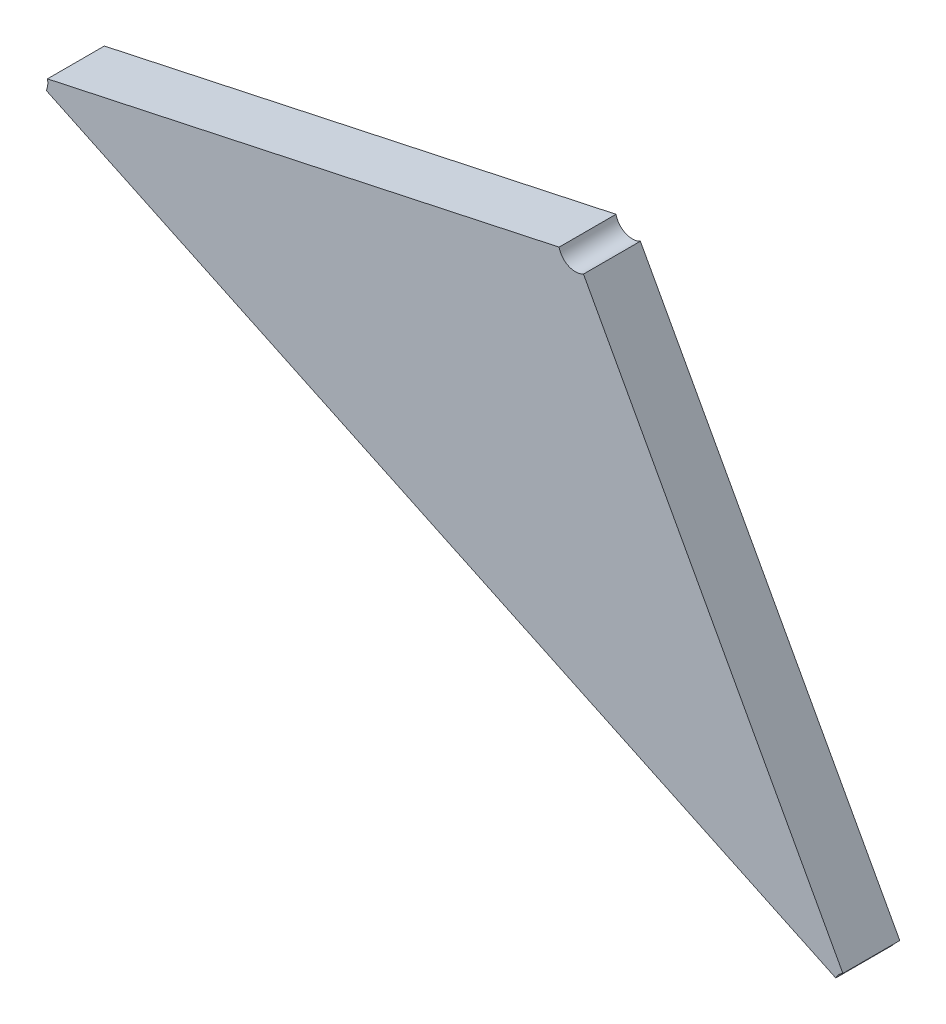
ISO-10303-21;
HEADER;
FILE_DESCRIPTION(('STEP AP214'),'2;1');
FILE_NAME('part.step','',(''),(''),'','','');
FILE_SCHEMA(('AUTOMOTIVE_DESIGN { 1 0 10303 214 1 1 1 1 }'));
ENDSEC;
DATA;
#1=APPLICATION_CONTEXT('core data for automotive mechanical design processes');
#2=APPLICATION_PROTOCOL_DEFINITION('international standard','automotive_design',2000,#1);
#3=PRODUCT_CONTEXT('',#1,'mechanical');
#4=PRODUCT('Part','Part','',(#3));
#5=PRODUCT_RELATED_PRODUCT_CATEGORY('part','',(#4));
#6=PRODUCT_DEFINITION_FORMATION('','',#4);
#7=PRODUCT_DEFINITION_CONTEXT('part definition',#1,'design');
#8=PRODUCT_DEFINITION('design','',#6,#7);
#9=PRODUCT_DEFINITION_SHAPE('','',#8);
#10=(LENGTH_UNIT() NAMED_UNIT(*) SI_UNIT(.MILLI.,.METRE.));
#11=(NAMED_UNIT(*) PLANE_ANGLE_UNIT() SI_UNIT($,.RADIAN.));
#12=(NAMED_UNIT(*) SI_UNIT($,.STERADIAN.) SOLID_ANGLE_UNIT());
#13=UNCERTAINTY_MEASURE_WITH_UNIT(LENGTH_MEASURE(1.E-05),#10,'distance_accuracy_value','');
#14=(GEOMETRIC_REPRESENTATION_CONTEXT(3) GLOBAL_UNCERTAINTY_ASSIGNED_CONTEXT((#13)) GLOBAL_UNIT_ASSIGNED_CONTEXT((#10,
#11,#12)) REPRESENTATION_CONTEXT('',''));
#15=CARTESIAN_POINT('',(0.,0.,0.));
#16=DIRECTION('',(0.,0.,1.));
#17=DIRECTION('',(1.,0.,0.));
#18=AXIS2_PLACEMENT_3D('',#15,#16,#17);
#19=CARTESIAN_POINT('',(-1.59189867768848,-1.40831289575818,0.0042));
#20=DIRECTION('',(0.,0.,1.));
#21=DIRECTION('',(1.,0.,0.));
#22=AXIS2_PLACEMENT_3D('',#19,#20,#21);
#23=PLANE('',#22);
#24=CARTESIAN_POINT('',(-1.54763776832546,-1.44184706335933,0.0042));
#25=DIRECTION('',(0.,0.,-1.));
#26=DIRECTION('',(-0.903806397976083,0.427941578930463,0.));
#27=AXIS2_PLACEMENT_3D('',#24,#25,#26);
#28=CIRCLE('',#27,0.00200000000000001);
#29=CARTESIAN_POINT('',(-1.54944538112141,-1.44099118020147,0.0042));
#30=VERTEX_POINT('',#29);
#31=CARTESIAN_POINT('',(-1.54859494511503,-1.4400909846044,0.0042));
#32=VERTEX_POINT('',#31);
#33=EDGE_CURVE('E11',#30,#32,#28,.T.);
#34=ORIENTED_EDGE('',*,*,#33,.T.);
#35=DIRECTION('',(-0.478588394782362,0.878039377465294,0.));
#36=VECTOR('',#35,1.);
#37=CARTESIAN_POINT('',(-1.54859494511503,-1.4400909846044,0.0042));
#38=LINE('',#37,#36);
#39=CARTESIAN_POINT('',(-1.57960265484959,-1.38320287271372,0.0042));
#40=VERTEX_POINT('',#39);
#41=EDGE_CURVE('E34',#32,#40,#38,.T.);
#42=ORIENTED_EDGE('',*,*,#41,.T.);
#43=CARTESIAN_POINT('',(-1.58055983163915,-1.38144679395879,0.0042));
#44=DIRECTION('',(0.,0.,-1.));
#45=DIRECTION('',(0.478588394780656,-0.878039377466225,0.));
#46=AXIS2_PLACEMENT_3D('',#43,#44,#45);
#47=CIRCLE('',#46,0.002);
#48=CARTESIAN_POINT('',(-1.58251507151909,-1.38186755162289,0.0042));
#49=VERTEX_POINT('',#48);
#50=EDGE_CURVE('E106',#40,#49,#47,.T.);
#51=ORIENTED_EDGE('',*,*,#50,.T.);
#52=DIRECTION('',(-0.977619939969144,-0.210378832050012,0.));
#53=VECTOR('',#52,1.);
#54=CARTESIAN_POINT('',(-1.58251507151909,-1.38186755162289,0.0042));
#55=LINE('',#54,#53);
#56=CARTESIAN_POINT('',(-1.64367380825012,-1.39502860028515,0.0042));
#57=VERTEX_POINT('',#56);
#58=EDGE_CURVE('E68',#49,#57,#55,.T.);
#59=ORIENTED_EDGE('',*,*,#58,.T.);
#60=CARTESIAN_POINT('',(-1.64562904813006,-1.39544935794925,0.0042));
#61=DIRECTION('',(0.,0.,-1.));
#62=DIRECTION('',(0.97761993996917,0.21037883204989,0.));
#63=AXIS2_PLACEMENT_3D('',#60,#61,#62);
#64=CIRCLE('',#63,0.00200000000000003);
#65=CARTESIAN_POINT('',(-1.64382143533411,-1.39630524110711,0.0042));
#66=VERTEX_POINT('',#65);
#67=EDGE_CURVE('E64',#57,#66,#64,.T.);
#68=ORIENTED_EDGE('',*,*,#67,.T.);
#69=DIRECTION('',(0.903806397975919,-0.427941578930811,0.));
#70=VECTOR('',#69,1.);
#71=CARTESIAN_POINT('',(-1.64382143533411,-1.39630524110711,0.0042));
#72=LINE('',#71,#70);
#73=EDGE_CURVE('E66',#66,#30,#72,.T.);
#74=ORIENTED_EDGE('',*,*,#73,.T.);
#75=EDGE_LOOP('',(#34,#42,#51,#59,#68,#74));
#76=FACE_BOUND('',#75,.T.);
#77=ADVANCED_FACE('F17',(#76),#23,.T.);
#78=CARTESIAN_POINT('',(-1.54763776832546,-1.44184706335933,-0.0018));
#79=DIRECTION('',(0.,0.,1.));
#80=DIRECTION('',(-1.,0.,0.));
#81=AXIS2_PLACEMENT_3D('',#78,#79,#80);
#82=CYLINDRICAL_SURFACE('',#81,0.00200000000000001);
#83=DIRECTION('',(0.,0.,-1.));
#84=VECTOR('',#83,1.);
#85=CARTESIAN_POINT('',(-1.54859494511503,-1.4400909846044,0.0042));
#86=LINE('',#85,#84);
#87=CARTESIAN_POINT('',(-1.54859494511503,-1.4400909846044,-0.0026));
#88=VERTEX_POINT('',#87);
#89=EDGE_CURVE('E24',#32,#88,#86,.T.);
#90=ORIENTED_EDGE('',*,*,#89,.F.);
#91=ORIENTED_EDGE('',*,*,#33,.F.);
#92=DIRECTION('',(0.,0.,1.));
#93=VECTOR('',#92,1.);
#94=CARTESIAN_POINT('',(-1.54944538112141,-1.44099118020147,-0.0026));
#95=LINE('',#94,#93);
#96=CARTESIAN_POINT('',(-1.54944538112141,-1.44099118020147,-0.0026));
#97=VERTEX_POINT('',#96);
#98=EDGE_CURVE('E81',#97,#30,#95,.T.);
#99=ORIENTED_EDGE('',*,*,#98,.F.);
#100=CARTESIAN_POINT('',(-1.54763776832546,-1.44184706335933,-0.0026));
#101=DIRECTION('',(0.,0.,1.));
#102=DIRECTION('',(-0.478588394784538,0.878039377464108,0.));
#103=AXIS2_PLACEMENT_3D('',#100,#101,#102);
#104=CIRCLE('',#103,0.00200000000000001);
#105=EDGE_CURVE('E72',#88,#97,#104,.T.);
#106=ORIENTED_EDGE('',*,*,#105,.F.);
#107=EDGE_LOOP('',(#90,#91,#99,#106));
#108=FACE_BOUND('',#107,.T.);
#109=ADVANCED_FACE('F128',(#108),#82,.F.);
#110=CARTESIAN_POINT('',(-1.58055983163915,-1.38144679395879,-0.0018));
#111=DIRECTION('',(0.,0.,1.));
#112=DIRECTION('',(-1.,0.,0.));
#113=AXIS2_PLACEMENT_3D('',#110,#111,#112);
#114=CYLINDRICAL_SURFACE('',#113,0.002);
#115=DIRECTION('',(0.,0.,1.));
#116=VECTOR('',#115,1.);
#117=CARTESIAN_POINT('',(-1.57960265484959,-1.38320287271372,-0.0026));
#118=LINE('',#117,#116);
#119=CARTESIAN_POINT('',(-1.57960265484959,-1.38320287271372,-0.0026));
#120=VERTEX_POINT('',#119);
#121=EDGE_CURVE('E108',#120,#40,#118,.T.);
#122=ORIENTED_EDGE('',*,*,#121,.F.);
#123=CARTESIAN_POINT('',(-1.58055983163915,-1.38144679395879,-0.0026));
#124=DIRECTION('',(0.,0.,1.));
#125=DIRECTION('',(-0.977619939969193,-0.210378832049784,0.));
#126=AXIS2_PLACEMENT_3D('',#123,#124,#125);
#127=CIRCLE('',#126,0.002);
#128=CARTESIAN_POINT('',(-1.58251507151909,-1.38186755162289,-0.0026));
#129=VERTEX_POINT('',#128);
#130=EDGE_CURVE('E101',#129,#120,#127,.T.);
#131=ORIENTED_EDGE('',*,*,#130,.F.);
#132=DIRECTION('',(0.,0.,-1.));
#133=VECTOR('',#132,1.);
#134=CARTESIAN_POINT('',(-1.58251507151909,-1.38186755162289,0.0042));
#135=LINE('',#134,#133);
#136=EDGE_CURVE('E95',#49,#129,#135,.T.);
#137=ORIENTED_EDGE('',*,*,#136,.F.);
#138=ORIENTED_EDGE('',*,*,#50,.F.);
#139=EDGE_LOOP('',(#122,#131,#137,#138));
#140=FACE_BOUND('',#139,.T.);
#141=ADVANCED_FACE('F126',(#140),#114,.F.);
#142=CARTESIAN_POINT('',(-1.64562904813006,-1.39544935794925,-0.0018));
#143=DIRECTION('',(0.,0.,1.));
#144=DIRECTION('',(0.993380341584749,-0.114871654262346,0.));
#145=AXIS2_PLACEMENT_3D('',#142,#143,#144);
#146=CYLINDRICAL_SURFACE('',#145,0.00200000000000003);
#147=DIRECTION('',(0.,0.,1.));
#148=VECTOR('',#147,1.);
#149=CARTESIAN_POINT('',(-1.64367380825012,-1.39502860028515,-0.0026));
#150=LINE('',#149,#148);
#151=CARTESIAN_POINT('',(-1.64367380825012,-1.39502860028515,-0.0026));
#152=VERTEX_POINT('',#151);
#153=EDGE_CURVE('E104',#152,#57,#150,.T.);
#154=ORIENTED_EDGE('',*,*,#153,.F.);
#155=CARTESIAN_POINT('',(-1.64562904813006,-1.39544935794925,-0.0026));
#156=DIRECTION('',(0.,0.,1.));
#157=DIRECTION('',(0.90380639797604,-0.427941578930554,0.));
#158=AXIS2_PLACEMENT_3D('',#155,#156,#157);
#159=CIRCLE('',#158,0.00200000000000003);
#160=CARTESIAN_POINT('',(-1.64382143533411,-1.39630524110711,-0.0026));
#161=VERTEX_POINT('',#160);
#162=EDGE_CURVE('E85',#161,#152,#159,.T.);
#163=ORIENTED_EDGE('',*,*,#162,.F.);
#164=DIRECTION('',(0.,0.,-1.));
#165=VECTOR('',#164,1.);
#166=CARTESIAN_POINT('',(-1.64382143533411,-1.39630524110711,0.0042));
#167=LINE('',#166,#165);
#168=EDGE_CURVE('E79',#66,#161,#167,.T.);
#169=ORIENTED_EDGE('',*,*,#168,.F.);
#170=ORIENTED_EDGE('',*,*,#67,.F.);
#171=EDGE_LOOP('',(#154,#163,#169,#170));
#172=FACE_BOUND('',#171,.T.);
#173=ADVANCED_FACE('F83',(#172),#146,.F.);
#174=CARTESIAN_POINT('',(-1.64562904813006,-1.39544935794925,-0.0026));
#175=DIRECTION('',(-0.427941578930813,-0.903806397975918,0.));
#176=DIRECTION('',(0.903806397975918,-0.427941578930813,0.));
#177=AXIS2_PLACEMENT_3D('',#174,#175,#176);
#178=PLANE('',#177);
#179=ORIENTED_EDGE('',*,*,#98,.T.);
#180=ORIENTED_EDGE('',*,*,#73,.F.);
#181=ORIENTED_EDGE('',*,*,#168,.T.);
#182=DIRECTION('',(0.903806397975918,-0.427941578930812,0.));
#183=VECTOR('',#182,1.);
#184=CARTESIAN_POINT('',(-1.64382143533411,-1.39630524110711,-0.0026));
#185=LINE('',#184,#183);
#186=EDGE_CURVE('E120',#161,#97,#185,.T.);
#187=ORIENTED_EDGE('',*,*,#186,.T.);
#188=EDGE_LOOP('',(#179,#180,#181,#187));
#189=FACE_BOUND('',#188,.T.);
#190=ADVANCED_FACE('F77',(#189),#178,.T.);
#191=CARTESIAN_POINT('',(-1.58055983163915,-1.38144679395879,-0.0026));
#192=DIRECTION('',(-0.210378832050013,0.977619939969144,0.));
#193=DIRECTION('',(-0.977619939969144,-0.210378832050013,0.));
#194=AXIS2_PLACEMENT_3D('',#191,#192,#193);
#195=PLANE('',#194);
#196=ORIENTED_EDGE('',*,*,#136,.T.);
#197=DIRECTION('',(-0.977619939969144,-0.210378832050012,0.));
#198=VECTOR('',#197,1.);
#199=CARTESIAN_POINT('',(-1.58251507151909,-1.38186755162289,-0.0026));
#200=LINE('',#199,#198);
#201=EDGE_CURVE('E86',#129,#152,#200,.T.);
#202=ORIENTED_EDGE('',*,*,#201,.T.);
#203=ORIENTED_EDGE('',*,*,#153,.T.);
#204=ORIENTED_EDGE('',*,*,#58,.F.);
#205=EDGE_LOOP('',(#196,#202,#203,#204));
#206=FACE_BOUND('',#205,.T.);
#207=ADVANCED_FACE('F123',(#206),#195,.T.);
#208=CARTESIAN_POINT('',(-1.54763776832546,-1.44184706335933,-0.0026));
#209=DIRECTION('',(0.878039377465294,0.478588394782364,0.));
#210=DIRECTION('',(-0.478588394782364,0.878039377465294,0.));
#211=AXIS2_PLACEMENT_3D('',#208,#209,#210);
#212=PLANE('',#211);
#213=ORIENTED_EDGE('',*,*,#89,.T.);
#214=DIRECTION('',(-0.478588394782361,0.878039377465295,0.));
#215=VECTOR('',#214,1.);
#216=CARTESIAN_POINT('',(-1.54859494511503,-1.4400909846044,-0.0026));
#217=LINE('',#216,#215);
#218=EDGE_CURVE('E89',#88,#120,#217,.T.);
#219=ORIENTED_EDGE('',*,*,#218,.T.);
#220=ORIENTED_EDGE('',*,*,#121,.T.);
#221=ORIENTED_EDGE('',*,*,#41,.F.);
#222=EDGE_LOOP('',(#213,#219,#220,#221));
#223=FACE_BOUND('',#222,.T.);
#224=ADVANCED_FACE('F115',(#223),#212,.T.);
#225=CARTESIAN_POINT('',(-1.59194690156625,-1.40842665404409,-0.0026));
#226=DIRECTION('',(0.,0.,1.));
#227=DIRECTION('',(1.,0.,0.));
#228=AXIS2_PLACEMENT_3D('',#225,#226,#227);
#229=PLANE('',#228);
#230=ORIENTED_EDGE('',*,*,#105,.T.);
#231=ORIENTED_EDGE('',*,*,#186,.F.);
#232=ORIENTED_EDGE('',*,*,#162,.T.);
#233=ORIENTED_EDGE('',*,*,#201,.F.);
#234=ORIENTED_EDGE('',*,*,#130,.T.);
#235=ORIENTED_EDGE('',*,*,#218,.F.);
#236=EDGE_LOOP('',(#230,#231,#232,#233,#234,#235));
#237=FACE_BOUND('',#236,.T.);
#238=ADVANCED_FACE('F118',(#237),#229,.F.);
#239=CLOSED_SHELL('',(#77,#109,#141,#173,#190,#207,#224,#238));
#240=MANIFOLD_SOLID_BREP('B1',#239);
#241=ADVANCED_BREP_SHAPE_REPRESENTATION('',(#18,#240),#14);
#242=SHAPE_DEFINITION_REPRESENTATION(#9,#241);
ENDSEC;
END-ISO-10303-21;
